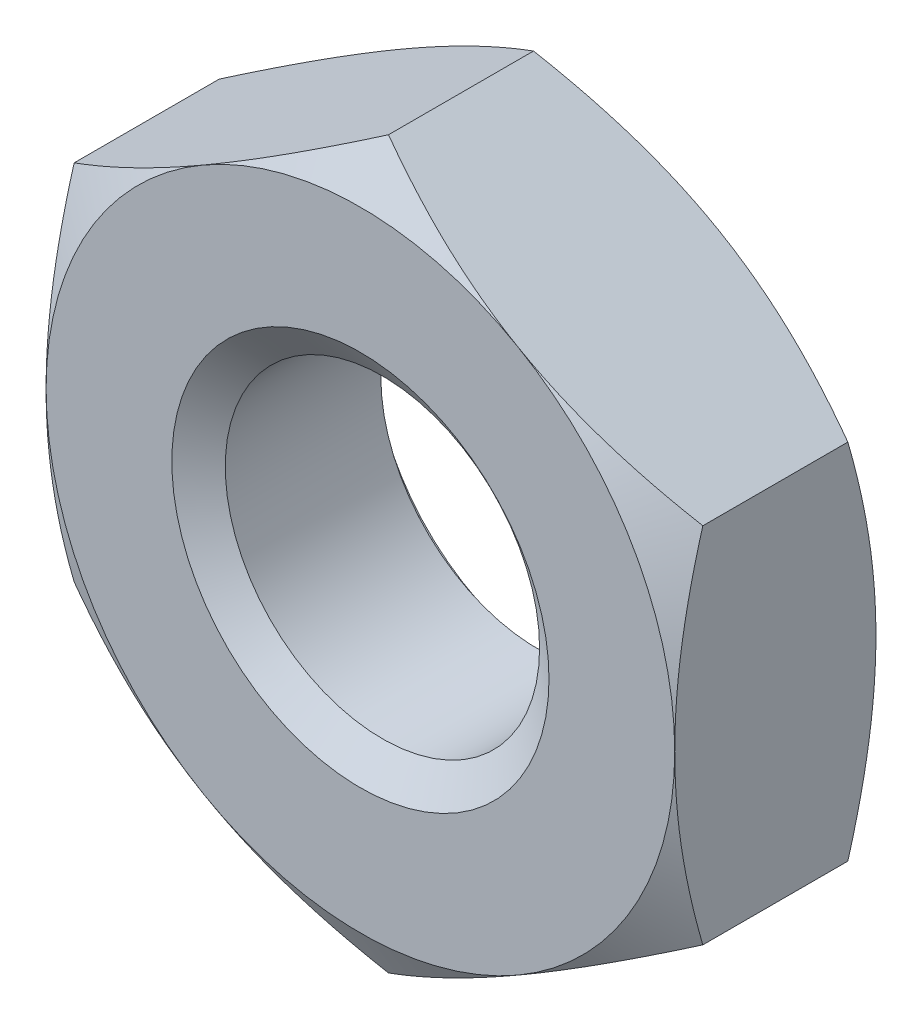
ISO-10303-21;
HEADER;
FILE_DESCRIPTION(('STEP AP214'),'2;1');
FILE_NAME('part.step','',(''),(''),'','','');
FILE_SCHEMA(('AUTOMOTIVE_DESIGN { 1 0 10303 214 1 1 1 1 }'));
ENDSEC;
DATA;
#1=APPLICATION_CONTEXT('core data for automotive mechanical design processes');
#2=APPLICATION_PROTOCOL_DEFINITION('international standard','automotive_design',2000,#1);
#3=PRODUCT_CONTEXT('',#1,'mechanical');
#4=PRODUCT('Part','Part','',(#3));
#5=PRODUCT_RELATED_PRODUCT_CATEGORY('part','',(#4));
#6=PRODUCT_DEFINITION_FORMATION('','',#4);
#7=PRODUCT_DEFINITION_CONTEXT('part definition',#1,'design');
#8=PRODUCT_DEFINITION('design','',#6,#7);
#9=PRODUCT_DEFINITION_SHAPE('','',#8);
#10=(LENGTH_UNIT() NAMED_UNIT(*) SI_UNIT(.MILLI.,.METRE.));
#11=(NAMED_UNIT(*) PLANE_ANGLE_UNIT() SI_UNIT($,.RADIAN.));
#12=(NAMED_UNIT(*) SI_UNIT($,.STERADIAN.) SOLID_ANGLE_UNIT());
#13=UNCERTAINTY_MEASURE_WITH_UNIT(LENGTH_MEASURE(1.E-05),#10,'distance_accuracy_value','');
#14=(GEOMETRIC_REPRESENTATION_CONTEXT(3) GLOBAL_UNCERTAINTY_ASSIGNED_CONTEXT((#13)) GLOBAL_UNIT_ASSIGNED_CONTEXT((#10,
#11,#12)) REPRESENTATION_CONTEXT('',''));
#15=CARTESIAN_POINT('',(0.,0.,0.));
#16=DIRECTION('',(0.,0.,1.));
#17=DIRECTION('',(1.,0.,0.));
#18=AXIS2_PLACEMENT_3D('',#15,#16,#17);
#19=CARTESIAN_POINT('',(0.,0.,-3.2));
#20=DIRECTION('',(0.,0.,1.));
#21=DIRECTION('',(1.,0.,0.));
#22=AXIS2_PLACEMENT_3D('',#19,#20,#21);
#23=CYLINDRICAL_SURFACE('',#22,2.5);
#24=CARTESIAN_POINT('',(0.,0.,-0.350103769104855));
#25=DIRECTION('',(0.,0.,1.));
#26=DIRECTION('',(1.,0.,0.));
#27=AXIS2_PLACEMENT_3D('',#24,#25,#26);
#28=CIRCLE('',#27,2.5);
#29=CARTESIAN_POINT('',(2.5,0.,-0.350103769104855));
#30=VERTEX_POINT('',#29);
#31=EDGE_CURVE('E177',#30,#30,#28,.F.);
#32=ORIENTED_EDGE('',*,*,#31,.F.);
#33=EDGE_LOOP('',(#32));
#34=FACE_BOUND('',#33,.T.);
#35=CARTESIAN_POINT('',(0.,0.,-2.82449623089514));
#36=DIRECTION('',(0.,0.,-1.));
#37=DIRECTION('',(-1.,0.,0.));
#38=AXIS2_PLACEMENT_3D('',#35,#36,#37);
#39=CIRCLE('',#38,2.5);
#40=CARTESIAN_POINT('',(-2.5,0.,-2.82449623089514));
#41=VERTEX_POINT('',#40);
#42=EDGE_CURVE('E42',#41,#41,#39,.F.);
#43=ORIENTED_EDGE('',*,*,#42,.F.);
#44=EDGE_LOOP('',(#43));
#45=FACE_BOUND('',#44,.T.);
#46=ADVANCED_FACE('F37',(#34,#45),#23,.F.);
#47=CARTESIAN_POINT('',(0.,5.77350269189626,-3.2));
#48=DIRECTION('',(0.,0.,-1.));
#49=DIRECTION('',(-1.,0.,0.));
#50=AXIS2_PLACEMENT_3D('',#47,#48,#49);
#51=PLANE('',#50);
#52=CARTESIAN_POINT('',(0.,0.,-3.2));
#53=DIRECTION('',(0.,0.,-1.));
#54=DIRECTION('',(-1.,0.,0.));
#55=AXIS2_PLACEMENT_3D('',#52,#53,#54);
#56=CIRCLE('',#55,5.);
#57=CARTESIAN_POINT('',(-5.,0.,-3.2));
#58=VERTEX_POINT('',#57);
#59=CARTESIAN_POINT('',(-2.5,-4.33012701892219,-3.2));
#60=VERTEX_POINT('',#59);
#61=EDGE_CURVE('E173',#58,#60,#56,.F.);
#62=ORIENTED_EDGE('',*,*,#61,.F.);
#63=CARTESIAN_POINT('',(-2.5,4.33012701892219,-3.2));
#64=VERTEX_POINT('',#63);
#65=EDGE_CURVE('E155',#64,#58,#56,.F.);
#66=ORIENTED_EDGE('',*,*,#65,.F.);
#67=CARTESIAN_POINT('',(2.5,4.33012701892219,-3.2));
#68=VERTEX_POINT('',#67);
#69=EDGE_CURVE('E172',#68,#64,#56,.F.);
#70=ORIENTED_EDGE('',*,*,#69,.F.);
#71=CARTESIAN_POINT('',(0.,0.,-3.2));
#72=DIRECTION('',(0.,0.,1.));
#73=DIRECTION('',(1.,0.,0.));
#74=AXIS2_PLACEMENT_3D('',#71,#72,#73);
#75=CIRCLE('',#74,5.);
#76=CARTESIAN_POINT('',(5.,0.,-3.2));
#77=VERTEX_POINT('',#76);
#78=EDGE_CURVE('E247',#77,#68,#75,.T.);
#79=ORIENTED_EDGE('',*,*,#78,.F.);
#80=CARTESIAN_POINT('',(2.5,-4.33012701892219,-3.2));
#81=VERTEX_POINT('',#80);
#82=EDGE_CURVE('E363',#81,#77,#56,.F.);
#83=ORIENTED_EDGE('',*,*,#82,.F.);
#84=EDGE_CURVE('E367',#60,#81,#56,.F.);
#85=ORIENTED_EDGE('',*,*,#84,.F.);
#86=EDGE_LOOP('',(#62,#66,#70,#79,#83,#85));
#87=FACE_BOUND('',#86,.T.);
#88=CARTESIAN_POINT('',(0.,0.,-3.2));
#89=DIRECTION('',(0.,0.,-1.));
#90=DIRECTION('',(-1.,0.,0.));
#91=AXIS2_PLACEMENT_3D('',#88,#89,#90);
#92=CIRCLE('',#91,3.);
#93=CARTESIAN_POINT('',(-3.,0.,-3.2));
#94=VERTEX_POINT('',#93);
#95=EDGE_CURVE('E180',#94,#94,#92,.F.);
#96=ORIENTED_EDGE('',*,*,#95,.T.);
#97=EDGE_LOOP('',(#96));
#98=FACE_BOUND('',#97,.T.);
#99=ADVANCED_FACE('F300',(#87,#98),#51,.T.);
#100=CARTESIAN_POINT('',(0.,5.77350269189626,0.));
#101=DIRECTION('',(0.,0.,-1.));
#102=DIRECTION('',(-1.,0.,0.));
#103=AXIS2_PLACEMENT_3D('',#100,#101,#102);
#104=PLANE('',#103);
#105=CARTESIAN_POINT('',(0.,0.,0.));
#106=DIRECTION('',(0.,0.,-1.));
#107=DIRECTION('',(-1.,0.,0.));
#108=AXIS2_PLACEMENT_3D('',#105,#106,#107);
#109=CIRCLE('',#108,5.);
#110=CARTESIAN_POINT('',(-5.,0.,0.));
#111=VERTEX_POINT('',#110);
#112=CARTESIAN_POINT('',(-2.5,4.33012701892219,0.));
#113=VERTEX_POINT('',#112);
#114=EDGE_CURVE('E11',#111,#113,#109,.T.);
#115=ORIENTED_EDGE('',*,*,#114,.F.);
#116=CARTESIAN_POINT('',(-2.5,-4.33012701892219,0.));
#117=VERTEX_POINT('',#116);
#118=EDGE_CURVE('E49',#117,#111,#109,.T.);
#119=ORIENTED_EDGE('',*,*,#118,.F.);
#120=CARTESIAN_POINT('',(2.5,-4.33012701892219,0.));
#121=VERTEX_POINT('',#120);
#122=EDGE_CURVE('E176',#121,#117,#109,.T.);
#123=ORIENTED_EDGE('',*,*,#122,.F.);
#124=CARTESIAN_POINT('',(5.,0.,0.));
#125=VERTEX_POINT('',#124);
#126=EDGE_CURVE('E354',#125,#121,#109,.T.);
#127=ORIENTED_EDGE('',*,*,#126,.F.);
#128=CARTESIAN_POINT('',(0.,0.,0.));
#129=DIRECTION('',(0.,0.,1.));
#130=DIRECTION('',(1.,0.,0.));
#131=AXIS2_PLACEMENT_3D('',#128,#129,#130);
#132=CIRCLE('',#131,5.);
#133=CARTESIAN_POINT('',(2.5,4.33012701892219,0.));
#134=VERTEX_POINT('',#133);
#135=EDGE_CURVE('E131',#125,#134,#132,.T.);
#136=ORIENTED_EDGE('',*,*,#135,.T.);
#137=EDGE_CURVE('E47',#113,#134,#109,.T.);
#138=ORIENTED_EDGE('',*,*,#137,.F.);
#139=EDGE_LOOP('',(#115,#119,#123,#127,#136,#138));
#140=FACE_BOUND('',#139,.T.);
#141=CARTESIAN_POINT('',(0.,0.,0.));
#142=DIRECTION('',(0.,0.,1.));
#143=DIRECTION('',(1.,0.,0.));
#144=AXIS2_PLACEMENT_3D('',#141,#142,#143);
#145=CIRCLE('',#144,3.);
#146=CARTESIAN_POINT('',(3.,0.,0.));
#147=VERTEX_POINT('',#146);
#148=EDGE_CURVE('E179',#147,#147,#145,.T.);
#149=ORIENTED_EDGE('',*,*,#148,.F.);
#150=EDGE_LOOP('',(#149));
#151=FACE_BOUND('',#150,.T.);
#152=ADVANCED_FACE('F252',(#140,#151),#104,.F.);
#153=CARTESIAN_POINT('',(0.,5.77350269189626,-3.2));
#154=DIRECTION('',(-0.500000000000001,0.866025403784438,0.));
#155=DIRECTION('',(-0.866025403784438,-0.500000000000001,0.));
#156=AXIS2_PLACEMENT_3D('',#153,#154,#155);
#157=PLANE('',#156);
#158=DIRECTION('',(0.,0.,1.));
#159=VECTOR('',#158,1.);
#160=CARTESIAN_POINT('',(-5.,2.88675134594813,-3.2));
#161=LINE('',#160,#159);
#162=CARTESIAN_POINT('',(-5.,2.88675134594813,-2.75341801261479));
#163=VERTEX_POINT('',#162);
#164=CARTESIAN_POINT('',(-5.,2.88675134594813,-0.446581987385205));
#165=VERTEX_POINT('',#164);
#166=EDGE_CURVE('E167',#163,#165,#161,.T.);
#167=ORIENTED_EDGE('',*,*,#166,.T.);
#168=CARTESIAN_POINT('',(-5.0002,2.88663587589429,-0.446648656051832));
#169=CARTESIAN_POINT('',(-4.78046540547481,3.01349970319368,-0.373386567637637));
#170=CARTESIAN_POINT('',(-4.55885141554042,3.14144859993849,-0.306751321918094));
#171=CARTESIAN_POINT('',(-4.11178600454649,3.39956193532121,-0.190438991010811));
#172=CARTESIAN_POINT('',(-3.88632664040923,3.52973095989718,-0.140803049915789));
#173=CARTESIAN_POINT('',(-3.43816769477649,3.78847564779798,-0.0635510254186975));
#174=CARTESIAN_POINT('',(-3.21553790689581,3.91701101576052,-0.0354203782834889));
#175=CARTESIAN_POINT('',(-2.88081009815336,4.11026620624323,-0.010194921953684));
#176=CARTESIAN_POINT('',(-2.76915780319494,4.17472868879311,-0.00461345976948341));
#177=CARTESIAN_POINT('',(-2.5457500293262,4.30371322717528,0.000797783248530168));
#178=CARTESIAN_POINT('',(-2.43399455370968,4.36823528110589,0.000627741741796764));
#179=CARTESIAN_POINT('',(-2.12781576914936,4.54500768479195,-0.00775363179203697));
#180=CARTESIAN_POINT('',(-1.93349391403278,4.65719946015293,-0.0218297718972522));
#181=CARTESIAN_POINT('',(-1.54613989800229,4.88083840557981,-0.0664652571094323));
#182=CARTESIAN_POINT('',(-1.35310909862843,4.9922847895602,-0.0970398601475101));
#183=CARTESIAN_POINT('',(-0.964974657525144,5.21637431361295,-0.173468493621167));
#184=CARTESIAN_POINT('',(-0.769920001358263,5.32898917185759,-0.219646378878683));
#185=CARTESIAN_POINT('',(-0.382719654641231,5.55253939626498,-0.324451794491938));
#186=CARTESIAN_POINT('',(-0.190569004591913,5.66347762579592,-0.383054703437379));
#187=CARTESIAN_POINT('',(0.000199999999999885,5.7736181619501,-0.446648656051834));
#188=B_SPLINE_CURVE_WITH_KNOTS('',3,(#168,#169,#170,#171,#172,#173,#174,#175,#176,#177,#178,
#179,#180,#181,#182,#183,#184,#185,#186,#187),.UNSPECIFIED.,.F.,.F.,(4,2,2,2,2,2,2,2,2,4),(0.,
0.792555841363092,1.58701660053334,2.36181537487281,2.74884076077326,3.13585419177295,
3.8096236259968,4.4840172390119,5.17336882348929,5.86136694793726),.UNSPECIFIED.);
#189=EDGE_CURVE('E136',#165,#113,#188,.T.);
#190=ORIENTED_EDGE('',*,*,#189,.T.);
#191=CARTESIAN_POINT('',(0.,5.77350269189626,-0.446581987385208));
#192=VERTEX_POINT('',#191);
#193=EDGE_CURVE('E56',#113,#192,#188,.T.);
#194=ORIENTED_EDGE('',*,*,#193,.T.);
#195=DIRECTION('',(0.,0.,1.));
#196=VECTOR('',#195,1.);
#197=CARTESIAN_POINT('',(0.,5.77350269189626,-3.2));
#198=LINE('',#197,#196);
#199=CARTESIAN_POINT('',(0.,5.77350269189626,-2.75341801261479));
#200=VERTEX_POINT('',#199);
#201=EDGE_CURVE('E152',#200,#192,#198,.T.);
#202=ORIENTED_EDGE('',*,*,#201,.F.);
#203=CARTESIAN_POINT('',(-5.0002,2.88663587589429,-2.75335134394817));
#204=CARTESIAN_POINT('',(-4.78046540547481,3.01349970319368,-2.82661343236236));
#205=CARTESIAN_POINT('',(-4.55885141554042,3.14144859993849,-2.89324867808191));
#206=CARTESIAN_POINT('',(-4.11178600454649,3.39956193532121,-3.00956100898919));
#207=CARTESIAN_POINT('',(-3.88632664040923,3.52973095989718,-3.05919695008421));
#208=CARTESIAN_POINT('',(-3.43816769477649,3.78847564779798,-3.1364489745813));
#209=CARTESIAN_POINT('',(-3.2155379068958,3.91701101576052,-3.16457962171651));
#210=CARTESIAN_POINT('',(-2.88081009815336,4.11026620624323,-3.18980507804632));
#211=CARTESIAN_POINT('',(-2.76915780319494,4.17472868879311,-3.19538654023052));
#212=CARTESIAN_POINT('',(-2.5457500293262,4.30371322717528,-3.20079778324853));
#213=CARTESIAN_POINT('',(-2.43399455370968,4.36823528110589,-3.2006277417418));
#214=CARTESIAN_POINT('',(-2.12781576914936,4.54500768479194,-3.19224636820796));
#215=CARTESIAN_POINT('',(-1.93349391403278,4.65719946015293,-3.17817022810275));
#216=CARTESIAN_POINT('',(-1.54613989800229,4.88083840557981,-3.13353474289057));
#217=CARTESIAN_POINT('',(-1.35310909862843,4.99228478956021,-3.10296013985249));
#218=CARTESIAN_POINT('',(-0.964974657525144,5.21637431361295,-3.02653150637883));
#219=CARTESIAN_POINT('',(-0.769920001358263,5.32898917185759,-2.98035362112132));
#220=CARTESIAN_POINT('',(-0.382719654641231,5.55253939626498,-2.87554820550806));
#221=CARTESIAN_POINT('',(-0.190569004591913,5.66347762579592,-2.81694529656262));
#222=CARTESIAN_POINT('',(0.000199999999999887,5.7736181619501,-2.75335134394817));
#223=B_SPLINE_CURVE_WITH_KNOTS('',3,(#203,#204,#205,#206,#207,#208,#209,#210,#211,#212,#213,
#214,#215,#216,#217,#218,#219,#220,#221,#222),.UNSPECIFIED.,.F.,.F.,(4,2,2,2,2,2,2,2,2,4),(0.,
0.792555841363092,1.58701660053334,2.36181537487281,2.74884076077326,3.13585419177295,
3.8096236259968,4.4840172390119,5.17336882348929,5.86136694793726),.UNSPECIFIED.);
#224=EDGE_CURVE('E170',#64,#200,#223,.T.);
#225=ORIENTED_EDGE('',*,*,#224,.F.);
#226=EDGE_CURVE('E262',#163,#64,#223,.T.);
#227=ORIENTED_EDGE('',*,*,#226,.F.);
#228=EDGE_LOOP('',(#167,#190,#194,#202,#225,#227));
#229=FACE_BOUND('',#228,.T.);
#230=ADVANCED_FACE('F39',(#229),#157,.T.);
#231=CARTESIAN_POINT('',(5.,2.88675134594813,-3.2));
#232=DIRECTION('',(0.500000000000001,0.866025403784438,0.));
#233=DIRECTION('',(-0.866025403784438,0.500000000000001,0.));
#234=AXIS2_PLACEMENT_3D('',#231,#232,#233);
#235=PLANE('',#234);
#236=ORIENTED_EDGE('',*,*,#201,.T.);
#237=CARTESIAN_POINT('',(-0.000199999999999944,5.7736181619501,-0.446648656051834));
#238=CARTESIAN_POINT('',(0.219534594525186,5.64675433465071,-0.37338656763764));
#239=CARTESIAN_POINT('',(0.441148584459581,5.5188054379059,-0.306751321918096));
#240=CARTESIAN_POINT('',(0.888213995453514,5.26069210252318,-0.190438991010813));
#241=CARTESIAN_POINT('',(1.11367335959078,5.13052307794721,-0.140803049915791));
#242=CARTESIAN_POINT('',(1.56183230522351,4.87177839004641,-0.0635510254186984));
#243=CARTESIAN_POINT('',(1.78446209310419,4.74324302208387,-0.0354203782834895));
#244=CARTESIAN_POINT('',(2.11918990184664,4.54998783160116,-0.0101949219536846));
#245=CARTESIAN_POINT('',(2.23084219680506,4.48552534905128,-0.00461345976948414));
#246=CARTESIAN_POINT('',(2.4542499706738,4.35654081066911,0.000797783248529637));
#247=CARTESIAN_POINT('',(2.56600544629032,4.2920187567385,0.00062774174179657));
#248=CARTESIAN_POINT('',(2.87218423085064,4.11524635305244,-0.00775363179203664));
#249=CARTESIAN_POINT('',(3.06650608596722,4.00305457769146,-0.021829771897252));
#250=CARTESIAN_POINT('',(3.45386010199771,3.77941563226457,-0.0664652571094318));
#251=CARTESIAN_POINT('',(3.64689090137157,3.66796924828418,-0.0970398601475091));
#252=CARTESIAN_POINT('',(4.03502534247486,3.44387972423144,-0.173468493621165));
#253=CARTESIAN_POINT('',(4.23007999864174,3.3312648659868,-0.219646378878682));
#254=CARTESIAN_POINT('',(4.61728034535877,3.1077146415794,-0.324451794491937));
#255=CARTESIAN_POINT('',(4.80943099540809,2.99677641204847,-0.383054703437377));
#256=CARTESIAN_POINT('',(5.0002,2.88663587589429,-0.446648656051832));
#257=B_SPLINE_CURVE_WITH_KNOTS('',3,(#237,#238,#239,#240,#241,#242,#243,#244,#245,#246,#247,
#248,#249,#250,#251,#252,#253,#254,#255,#256),.UNSPECIFIED.,.F.,.F.,(4,2,2,2,2,2,2,2,2,4),(0.,
0.792555841363092,1.58701660053334,2.36181537487281,2.74884076077326,3.13585419177296,
3.8096236259968,4.4840172390119,5.17336882348929,5.86136694793726),.UNSPECIFIED.);
#258=EDGE_CURVE('E146',#192,#134,#257,.T.);
#259=ORIENTED_EDGE('',*,*,#258,.T.);
#260=CARTESIAN_POINT('',(5.,2.88675134594813,-0.446581987385208));
#261=VERTEX_POINT('',#260);
#262=EDGE_CURVE('E63',#134,#261,#257,.T.);
#263=ORIENTED_EDGE('',*,*,#262,.T.);
#264=DIRECTION('',(0.,0.,1.));
#265=VECTOR('',#264,1.);
#266=CARTESIAN_POINT('',(5.,2.88675134594813,-3.2));
#267=LINE('',#266,#265);
#268=CARTESIAN_POINT('',(5.,2.88675134594813,-2.75341801261479));
#269=VERTEX_POINT('',#268);
#270=EDGE_CURVE('E145',#269,#261,#267,.T.);
#271=ORIENTED_EDGE('',*,*,#270,.F.);
#272=CARTESIAN_POINT('',(-0.00019999999999993,5.7736181619501,-2.75335134394817));
#273=CARTESIAN_POINT('',(0.219534594525186,5.64675433465071,-2.82661343236236));
#274=CARTESIAN_POINT('',(0.441148584459581,5.5188054379059,-2.8932486780819));
#275=CARTESIAN_POINT('',(0.888213995453514,5.26069210252318,-3.00956100898919));
#276=CARTESIAN_POINT('',(1.11367335959078,5.13052307794721,-3.05919695008421));
#277=CARTESIAN_POINT('',(1.56183230522351,4.87177839004641,-3.1364489745813));
#278=CARTESIAN_POINT('',(1.78446209310419,4.74324302208387,-3.16457962171651));
#279=CARTESIAN_POINT('',(2.11918990184664,4.54998783160116,-3.18980507804632));
#280=CARTESIAN_POINT('',(2.23084219680506,4.48552534905128,-3.19538654023052));
#281=CARTESIAN_POINT('',(2.4542499706738,4.35654081066911,-3.20079778324853));
#282=CARTESIAN_POINT('',(2.56600544629032,4.2920187567385,-3.2006277417418));
#283=CARTESIAN_POINT('',(2.87218423085064,4.11524635305244,-3.19224636820796));
#284=CARTESIAN_POINT('',(3.06650608596722,4.00305457769146,-3.17817022810275));
#285=CARTESIAN_POINT('',(3.45386010199771,3.77941563226457,-3.13353474289057));
#286=CARTESIAN_POINT('',(3.64689090137157,3.66796924828418,-3.10296013985249));
#287=CARTESIAN_POINT('',(4.03502534247486,3.44387972423144,-3.02653150637884));
#288=CARTESIAN_POINT('',(4.23007999864174,3.3312648659868,-2.98035362112132));
#289=CARTESIAN_POINT('',(4.61728034535877,3.1077146415794,-2.87554820550806));
#290=CARTESIAN_POINT('',(4.80943099540809,2.99677641204847,-2.81694529656262));
#291=CARTESIAN_POINT('',(5.0002,2.88663587589429,-2.75335134394817));
#292=B_SPLINE_CURVE_WITH_KNOTS('',3,(#272,#273,#274,#275,#276,#277,#278,#279,#280,#281,#282,
#283,#284,#285,#286,#287,#288,#289,#290,#291),.UNSPECIFIED.,.F.,.F.,(4,2,2,2,2,2,2,2,2,4),(0.,
0.792555841363092,1.58701660053334,2.36181537487281,2.74884076077326,3.13585419177296,
3.8096236259968,4.4840172390119,5.17336882348929,5.86136694793726),.UNSPECIFIED.);
#293=EDGE_CURVE('E256',#68,#269,#292,.T.);
#294=ORIENTED_EDGE('',*,*,#293,.F.);
#295=EDGE_CURVE('E261',#200,#68,#292,.T.);
#296=ORIENTED_EDGE('',*,*,#295,.F.);
#297=EDGE_LOOP('',(#236,#259,#263,#271,#294,#296));
#298=FACE_BOUND('',#297,.T.);
#299=ADVANCED_FACE('F143',(#298),#235,.T.);
#300=CARTESIAN_POINT('',(5.,2.88675134594813,-3.2));
#301=DIRECTION('',(-1.,0.,0.));
#302=DIRECTION('',(0.,0.,1.));
#303=AXIS2_PLACEMENT_3D('',#300,#301,#302);
#304=PLANE('',#303);
#305=CARTESIAN_POINT('',(5.,-7.65608998744865,-2.39263352655081));
#306=CARTESIAN_POINT('',(5.,-7.43656171400166,-2.28654533817208));
#307=CARTESIAN_POINT('',(5.,-7.21651440170022,-2.18151175461596));
#308=CARTESIAN_POINT('',(5.,-6.77510105921518,-1.97415643363977));
#309=CARTESIAN_POINT('',(5.,-6.55373480873053,-1.87183516574569));
#310=CARTESIAN_POINT('',(5.,-6.10820714710357,-1.66996807853491));
#311=CARTESIAN_POINT('',(5.,-5.88403698971124,-1.57044149281731));
#312=CARTESIAN_POINT('',(5.,-5.43385418074677,-1.37566323278682));
#313=CARTESIAN_POINT('',(5.,-5.20784162594278,-1.28041133564243));
#314=CARTESIAN_POINT('',(5.,-4.75080884782756,-1.09418830918942));
#315=CARTESIAN_POINT('',(5.,-4.51976121099505,-1.0032840909987));
#316=CARTESIAN_POINT('',(5.,-4.054940534221,-0.828595302971952));
#317=CARTESIAN_POINT('',(5.,-3.82116719434025,-0.744811525247655));
#318=CARTESIAN_POINT('',(5.,-3.35100416711889,-0.586614632364621));
#319=CARTESIAN_POINT('',(5.,-3.11462125088188,-0.512181595225273));
#320=CARTESIAN_POINT('',(5.,-2.63849247870023,-0.375104393872379));
#321=CARTESIAN_POINT('',(5.,-2.3987477121033,-0.31245650159695));
#322=CARTESIAN_POINT('',(5.,-1.91574303714497,-0.201987753994869));
#323=CARTESIAN_POINT('',(5.,-1.672482210841,-0.154170846558642));
#324=CARTESIAN_POINT('',(5.,-1.18299359688664,-0.0765955557924025));
#325=CARTESIAN_POINT('',(5.,-0.936765806613279,-0.0468371884284092));
#326=CARTESIAN_POINT('',(5.,-0.567032279323846,-0.0176512015862964));
#327=CARTESIAN_POINT('',(5.,-0.444105297658538,-0.0104963190599469));
#328=CARTESIAN_POINT('',(5.,-0.198053005238564,-0.00139545226904072));
#329=CARTESIAN_POINT('',(5.,-0.0749276970802274,0.000550599639614562));
#330=CARTESIAN_POINT('',(5.,0.171257999892354,-0.000818470345664083));
#331=CARTESIAN_POINT('',(5.,0.29431839722709,-0.00413211431301174));
#332=CARTESIAN_POINT('',(5.,0.540192730788842,-0.0159365972827602));
#333=CARTESIAN_POINT('',(5.,0.663006654263485,-0.0244276975701652));
#334=CARTESIAN_POINT('',(5.,0.960681872881669,-0.0511063802753011));
#335=CARTESIAN_POINT('',(5.,1.1353143627994,-0.0718889676982867));
#336=CARTESIAN_POINT('',(5.,1.48321675799389,-0.122765655722696));
#337=CARTESIAN_POINT('',(5.,1.65648647841236,-0.152860997990035));
#338=CARTESIAN_POINT('',(5.,2.00155426058699,-0.221298792011552));
#339=CARTESIAN_POINT('',(5.,2.17335067370373,-0.259649477486405));
#340=CARTESIAN_POINT('',(5.,2.51518168221054,-0.343428305385012));
#341=CARTESIAN_POINT('',(5.,2.6852163841931,-0.388856016914002));
#342=CARTESIAN_POINT('',(5.,3.02770318928892,-0.486887782054293));
#343=CARTESIAN_POINT('',(5.,3.20011248435311,-0.539640363823942));
#344=CARTESIAN_POINT('',(5.,3.54310870430176,-0.650357787302626));
#345=CARTESIAN_POINT('',(5.,3.71369679659714,-0.70831903390707));
#346=CARTESIAN_POINT('',(5.,4.05236610267973,-0.828256540728473));
#347=CARTESIAN_POINT('',(5.,4.22045602230055,-0.890208365426365));
#348=CARTESIAN_POINT('',(5.,4.55533171687448,-1.01774823413812));
#349=CARTESIAN_POINT('',(5.,4.72211693321414,-1.08333774778777));
#350=CARTESIAN_POINT('',(5.,4.88829623733355,-1.15038625817724));
#351=B_SPLINE_CURVE_WITH_KNOTS('',3,(#305,#306,#307,#308,#309,#310,#311,#312,#313,#314,#315,
#316,#317,#318,#319,#320,#321,#322,#323,#324,#325,#326,#327,#328,#329,#330,#331,#332,#333,#334,
#335,#336,#337,#338,#339,#340,#341,#342,#343,#344,#345,#346,#347,#348,#349,#350),.UNSPECIFIED.,
.F.,.F.,(4,2,2,2,2,2,2,2,2,2,2,2,2,2,2,2,2,2,2,2,2,2,4),(0.,0.731464740665351,1.46305528824908,
2.19883243307486,2.93457117856034,3.67934251246858,4.42419659013361,5.1674358087199,
5.91043951739339,6.65364083834807,7.39684281638516,7.76615414335457,8.13546067426611,
8.50466345177856,8.87388486298453,9.40118542949727,9.92855633110015,10.4564556797854,
10.9843228991235,11.525120280828,12.065547221064,12.6029322754131,13.1405360390026),.UNSPECIFIED.);
#352=CARTESIAN_POINT('',(5.,-2.88675134594813,-0.446581987385208));
#353=VERTEX_POINT('',#352);
#354=EDGE_CURVE('E138',#353,#125,#351,.T.);
#355=ORIENTED_EDGE('',*,*,#354,.F.);
#356=DIRECTION('',(0.,0.,1.));
#357=VECTOR('',#356,1.);
#358=CARTESIAN_POINT('',(5.,-2.88675134594813,-3.2));
#359=LINE('',#358,#357);
#360=CARTESIAN_POINT('',(5.,-2.88675134594813,-2.75341801261479));
#361=VERTEX_POINT('',#360);
#362=EDGE_CURVE('E153',#361,#353,#359,.T.);
#363=ORIENTED_EDGE('',*,*,#362,.F.);
#364=CARTESIAN_POINT('',(5.,-7.65608998744865,-0.807366473449195));
#365=CARTESIAN_POINT('',(5.,-7.43656171400166,-0.913454661827922));
#366=CARTESIAN_POINT('',(5.,-7.21651440170022,-1.01848824538404));
#367=CARTESIAN_POINT('',(5.,-6.77510105921518,-1.22584356636023));
#368=CARTESIAN_POINT('',(5.,-6.55373480873052,-1.32816483425431));
#369=CARTESIAN_POINT('',(5.,-6.10820714710357,-1.53003192146509));
#370=CARTESIAN_POINT('',(5.,-5.88403698971124,-1.62955850718269));
#371=CARTESIAN_POINT('',(5.,-5.43385418074677,-1.82433676721318));
#372=CARTESIAN_POINT('',(5.,-5.20784162594278,-1.91958866435757));
#373=CARTESIAN_POINT('',(5.,-4.75080884782756,-2.10581169081058));
#374=CARTESIAN_POINT('',(5.,-4.51976121099505,-2.1967159090013));
#375=CARTESIAN_POINT('',(5.,-4.05494053422099,-2.37140469702805));
#376=CARTESIAN_POINT('',(5.,-3.82116719434025,-2.45518847475235));
#377=CARTESIAN_POINT('',(5.,-3.35100416711889,-2.61338536763538));
#378=CARTESIAN_POINT('',(5.,-3.11462125088188,-2.68781840477473));
#379=CARTESIAN_POINT('',(5.,-2.63849247870023,-2.82489560612762));
#380=CARTESIAN_POINT('',(5.,-2.3987477121033,-2.88754349840305));
#381=CARTESIAN_POINT('',(5.,-1.91574303714497,-2.99801224600513));
#382=CARTESIAN_POINT('',(5.,-1.672482210841,-3.04582915344136));
#383=CARTESIAN_POINT('',(5.,-1.18299359688664,-3.1234044442076));
#384=CARTESIAN_POINT('',(5.,-0.936765806613281,-3.15316281157159));
#385=CARTESIAN_POINT('',(5.,-0.567032279323847,-3.1823487984137));
#386=CARTESIAN_POINT('',(5.,-0.444105297658539,-3.18950368094005));
#387=CARTESIAN_POINT('',(5.,-0.198053005238564,-3.19860454773096));
#388=CARTESIAN_POINT('',(5.,-0.0749276970802276,-3.20055059963961));
#389=CARTESIAN_POINT('',(5.,0.171257999892354,-3.19918152965434));
#390=CARTESIAN_POINT('',(5.,0.294318397227089,-3.19586788568699));
#391=CARTESIAN_POINT('',(5.,0.540192730788842,-3.18406340271724));
#392=CARTESIAN_POINT('',(5.,0.663006654263486,-3.17557230242983));
#393=CARTESIAN_POINT('',(5.,0.960681872881669,-3.1488936197247));
#394=CARTESIAN_POINT('',(5.,1.1353143627994,-3.12811103230171));
#395=CARTESIAN_POINT('',(5.,1.48321675799389,-3.0772343442773));
#396=CARTESIAN_POINT('',(5.,1.65648647841236,-3.04713900200997));
#397=CARTESIAN_POINT('',(5.,2.00155426058699,-2.97870120798845));
#398=CARTESIAN_POINT('',(5.,2.17335067370373,-2.9403505225136));
#399=CARTESIAN_POINT('',(5.,2.51518168221054,-2.85657169461499));
#400=CARTESIAN_POINT('',(5.,2.6852163841931,-2.811143983086));
#401=CARTESIAN_POINT('',(5.,3.02770318928892,-2.71311221794571));
#402=CARTESIAN_POINT('',(5.,3.20011248435311,-2.66035963617606));
#403=CARTESIAN_POINT('',(5.,3.54310870430176,-2.54964221269737));
#404=CARTESIAN_POINT('',(5.,3.71369679659714,-2.49168096609293));
#405=CARTESIAN_POINT('',(5.,4.05236610267973,-2.37174345927153));
#406=CARTESIAN_POINT('',(5.,4.22045602230055,-2.30979163457364));
#407=CARTESIAN_POINT('',(5.,4.55533171687448,-2.18225176586188));
#408=CARTESIAN_POINT('',(5.,4.72211693321414,-2.11666225221223));
#409=CARTESIAN_POINT('',(5.,4.88829623733355,-2.04961374182276));
#410=B_SPLINE_CURVE_WITH_KNOTS('',3,(#364,#365,#366,#367,#368,#369,#370,#371,#372,#373,#374,
#375,#376,#377,#378,#379,#380,#381,#382,#383,#384,#385,#386,#387,#388,#389,#390,#391,#392,#393,
#394,#395,#396,#397,#398,#399,#400,#401,#402,#403,#404,#405,#406,#407,#408,#409),.UNSPECIFIED.,
.F.,.F.,(4,2,2,2,2,2,2,2,2,2,2,2,2,2,2,2,2,2,2,2,2,2,4),(0.,0.731464740665352,1.46305528824909,
2.19883243307486,2.93457117856034,3.67934251246858,4.42419659013362,5.1674358087199,
5.91043951739339,6.65364083834806,7.39684281638516,7.76615414335457,8.13546067426611,
8.50466345177856,8.87388486298453,9.40118542949728,9.92855633110015,10.4564556797854,
10.9843228991235,11.525120280828,12.065547221064,12.6029322754131,13.1405360390026),.UNSPECIFIED.);
#411=EDGE_CURVE('E268',#361,#77,#410,.T.);
#412=ORIENTED_EDGE('',*,*,#411,.T.);
#413=EDGE_CURVE('E151',#77,#269,#410,.T.);
#414=ORIENTED_EDGE('',*,*,#413,.T.);
#415=ORIENTED_EDGE('',*,*,#270,.T.);
#416=EDGE_CURVE('E128',#125,#261,#351,.T.);
#417=ORIENTED_EDGE('',*,*,#416,.F.);
#418=EDGE_LOOP('',(#355,#363,#412,#414,#415,#417));
#419=FACE_BOUND('',#418,.T.);
#420=ADVANCED_FACE('F149',(#419),#304,.F.);
#421=CARTESIAN_POINT('',(0.,-5.77350269189627,-3.2));
#422=DIRECTION('',(0.500000000000001,-0.866025403784438,0.));
#423=DIRECTION('',(0.866025403784438,0.500000000000001,0.));
#424=AXIS2_PLACEMENT_3D('',#421,#422,#423);
#425=PLANE('',#424);
#426=ORIENTED_EDGE('',*,*,#362,.T.);
#427=CARTESIAN_POINT('',(5.0002,-2.8866358758943,-0.446648656051834));
#428=CARTESIAN_POINT('',(4.78046540547481,-3.01349970319368,-0.373386567637639));
#429=CARTESIAN_POINT('',(4.55885141554042,-3.14144859993849,-0.306751321918095));
#430=CARTESIAN_POINT('',(4.11178600454648,-3.39956193532121,-0.190438991010813));
#431=CARTESIAN_POINT('',(3.88632664040922,-3.52973095989718,-0.140803049915791));
#432=CARTESIAN_POINT('',(3.43816769477649,-3.78847564779798,-0.0635510254186998));
#433=CARTESIAN_POINT('',(3.2155379068958,-3.91701101576052,-0.0354203782834916));
#434=CARTESIAN_POINT('',(2.88081009815335,-4.11026620624323,-0.0101949219536866));
#435=CARTESIAN_POINT('',(2.76915780319494,-4.17472868879311,-0.00461345976948596));
#436=CARTESIAN_POINT('',(2.5457500293262,-4.30371322717528,0.000797783248527456));
#437=CARTESIAN_POINT('',(2.43399455370968,-4.3682352811059,0.000627741741793833));
#438=CARTESIAN_POINT('',(2.12781576914936,-4.54500768479195,-0.00775363179204044));
#439=CARTESIAN_POINT('',(1.93349391403278,-4.65719946015293,-0.021829771897256));
#440=CARTESIAN_POINT('',(1.54613989800229,-4.88083840557982,-0.0664652571094358));
#441=CARTESIAN_POINT('',(1.35310909862843,-4.99228478956021,-0.0970398601475132));
#442=CARTESIAN_POINT('',(0.964974657525143,-5.21637431361296,-0.17346849362117));
#443=CARTESIAN_POINT('',(0.769920001358262,-5.3289891718576,-0.219646378878687));
#444=CARTESIAN_POINT('',(0.38271965464123,-5.55253939626499,-0.324451794491942));
#445=CARTESIAN_POINT('',(0.190569004591913,-5.66347762579593,-0.383054703437383));
#446=CARTESIAN_POINT('',(-0.000200000000000091,-5.7736181619501,-0.446648656051837));
#447=B_SPLINE_CURVE_WITH_KNOTS('',3,(#427,#428,#429,#430,#431,#432,#433,#434,#435,#436,#437,
#438,#439,#440,#441,#442,#443,#444,#445,#446),.UNSPECIFIED.,.F.,.F.,(4,2,2,2,2,2,2,2,2,4),(0.,
0.792555841363093,1.58701660053334,2.36181537487281,2.74884076077326,3.13585419177295,
3.8096236259968,4.4840172390119,5.17336882348929,5.86136694793725),.UNSPECIFIED.);
#448=EDGE_CURVE('E349',#353,#121,#447,.T.);
#449=ORIENTED_EDGE('',*,*,#448,.T.);
#450=CARTESIAN_POINT('',(0.,-5.77350269189626,-0.446581987385208));
#451=VERTEX_POINT('',#450);
#452=EDGE_CURVE('E228',#121,#451,#447,.T.);
#453=ORIENTED_EDGE('',*,*,#452,.T.);
#454=DIRECTION('',(0.,0.,1.));
#455=VECTOR('',#454,1.);
#456=CARTESIAN_POINT('',(0.,-5.77350269189627,-3.2));
#457=LINE('',#456,#455);
#458=CARTESIAN_POINT('',(0.,-5.77350269189626,-2.75341801261479));
#459=VERTEX_POINT('',#458);
#460=EDGE_CURVE('E158',#459,#451,#457,.T.);
#461=ORIENTED_EDGE('',*,*,#460,.F.);
#462=CARTESIAN_POINT('',(5.0002,-2.8866358758943,-2.75335134394817));
#463=CARTESIAN_POINT('',(4.78046540547481,-3.01349970319368,-2.82661343236236));
#464=CARTESIAN_POINT('',(4.55885141554042,-3.14144859993849,-2.8932486780819));
#465=CARTESIAN_POINT('',(4.11178600454648,-3.39956193532121,-3.00956100898919));
#466=CARTESIAN_POINT('',(3.88632664040922,-3.52973095989718,-3.05919695008421));
#467=CARTESIAN_POINT('',(3.43816769477649,-3.78847564779798,-3.1364489745813));
#468=CARTESIAN_POINT('',(3.2155379068958,-3.91701101576052,-3.16457962171651));
#469=CARTESIAN_POINT('',(2.88081009815335,-4.11026620624323,-3.18980507804631));
#470=CARTESIAN_POINT('',(2.76915780319494,-4.17472868879311,-3.19538654023051));
#471=CARTESIAN_POINT('',(2.5457500293262,-4.30371322717528,-3.20079778324853));
#472=CARTESIAN_POINT('',(2.43399455370968,-4.3682352811059,-3.20062774174179));
#473=CARTESIAN_POINT('',(2.12781576914936,-4.54500768479195,-3.19224636820796));
#474=CARTESIAN_POINT('',(1.93349391403278,-4.65719946015293,-3.17817022810274));
#475=CARTESIAN_POINT('',(1.54613989800229,-4.88083840557982,-3.13353474289056));
#476=CARTESIAN_POINT('',(1.35310909862843,-4.99228478956021,-3.10296013985249));
#477=CARTESIAN_POINT('',(0.964974657525143,-5.21637431361296,-3.02653150637883));
#478=CARTESIAN_POINT('',(0.769920001358262,-5.3289891718576,-2.98035362112131));
#479=CARTESIAN_POINT('',(0.38271965464123,-5.55253939626499,-2.87554820550806));
#480=CARTESIAN_POINT('',(0.190569004591913,-5.66347762579593,-2.81694529656262));
#481=CARTESIAN_POINT('',(-0.000200000000000087,-5.7736181619501,-2.75335134394816));
#482=B_SPLINE_CURVE_WITH_KNOTS('',3,(#462,#463,#464,#465,#466,#467,#468,#469,#470,#471,#472,
#473,#474,#475,#476,#477,#478,#479,#480,#481),.UNSPECIFIED.,.F.,.F.,(4,2,2,2,2,2,2,2,2,4),(0.,
0.792555841363093,1.58701660053334,2.36181537487281,2.74884076077326,3.13585419177295,
3.8096236259968,4.4840172390119,5.17336882348929,5.86136694793726),.UNSPECIFIED.);
#483=EDGE_CURVE('E274',#81,#459,#482,.T.);
#484=ORIENTED_EDGE('',*,*,#483,.F.);
#485=EDGE_CURVE('E273',#361,#81,#482,.T.);
#486=ORIENTED_EDGE('',*,*,#485,.F.);
#487=EDGE_LOOP('',(#426,#449,#453,#461,#484,#486));
#488=FACE_BOUND('',#487,.T.);
#489=ADVANCED_FACE('F284',(#488),#425,.T.);
#490=CARTESIAN_POINT('',(-5.,-2.88675134594813,-3.2));
#491=DIRECTION('',(-0.500000000000001,-0.866025403784438,0.));
#492=DIRECTION('',(0.866025403784438,-0.500000000000001,0.));
#493=AXIS2_PLACEMENT_3D('',#490,#491,#492);
#494=PLANE('',#493);
#495=ORIENTED_EDGE('',*,*,#460,.T.);
#496=CARTESIAN_POINT('',(0.000199999999999675,-5.7736181619501,-0.446648656051837));
#497=CARTESIAN_POINT('',(-0.219534594525186,-5.64675433465071,-0.373386567637642));
#498=CARTESIAN_POINT('',(-0.441148584459582,-5.5188054379059,-0.306751321918099));
#499=CARTESIAN_POINT('',(-0.888213995453516,-5.26069210252319,-0.190438991010816));
#500=CARTESIAN_POINT('',(-1.11367335959078,-5.13052307794722,-0.140803049915793));
#501=CARTESIAN_POINT('',(-1.56183230522351,-4.87177839004641,-0.0635510254187014));
#502=CARTESIAN_POINT('',(-1.7844620931042,-4.74324302208387,-0.0354203782834928));
#503=CARTESIAN_POINT('',(-2.11918990184665,-4.54998783160117,-0.0101949219536873));
#504=CARTESIAN_POINT('',(-2.23084219680507,-4.48552534905128,-0.00461345976948643));
#505=CARTESIAN_POINT('',(-2.4542499706738,-4.35654081066911,0.000797783248527422));
#506=CARTESIAN_POINT('',(-2.56600544629032,-4.2920187567385,0.000627741741794034));
#507=CARTESIAN_POINT('',(-2.87218423085065,-4.11524635305245,-0.00775363179203975));
#508=CARTESIAN_POINT('',(-3.06650608596722,-4.00305457769146,-0.0218297718972551));
#509=CARTESIAN_POINT('',(-3.45386010199771,-3.77941563226458,-0.0664652571094346));
#510=CARTESIAN_POINT('',(-3.64689090137157,-3.66796924828419,-0.0970398601475116));
#511=CARTESIAN_POINT('',(-4.03502534247486,-3.44387972423144,-0.173468493621167));
#512=CARTESIAN_POINT('',(-4.23007999864174,-3.3312648659868,-0.219646378878684));
#513=CARTESIAN_POINT('',(-4.61728034535877,-3.10771464157941,-0.324451794491939));
#514=CARTESIAN_POINT('',(-4.80943099540809,-2.99677641204847,-0.383054703437379));
#515=CARTESIAN_POINT('',(-5.0002,-2.8866358758943,-0.446648656051833));
#516=B_SPLINE_CURVE_WITH_KNOTS('',3,(#496,#497,#498,#499,#500,#501,#502,#503,#504,#505,#506,
#507,#508,#509,#510,#511,#512,#513,#514,#515),.UNSPECIFIED.,.F.,.F.,(4,2,2,2,2,2,2,2,2,4),(0.,
0.792555841363093,1.58701660053334,2.36181537487281,2.74884076077326,3.13585419177296,
3.8096236259968,4.4840172390119,5.17336882348929,5.86136694793725),.UNSPECIFIED.);
#517=EDGE_CURVE('E347',#451,#117,#516,.T.);
#518=ORIENTED_EDGE('',*,*,#517,.T.);
#519=CARTESIAN_POINT('',(-5.,-2.88675134594813,-0.446581987385208));
#520=VERTEX_POINT('',#519);
#521=EDGE_CURVE('E202',#117,#520,#516,.T.);
#522=ORIENTED_EDGE('',*,*,#521,.T.);
#523=DIRECTION('',(0.,0.,1.));
#524=VECTOR('',#523,1.);
#525=CARTESIAN_POINT('',(-5.,-2.88675134594813,-3.2));
#526=LINE('',#525,#524);
#527=CARTESIAN_POINT('',(-5.,-2.88675134594813,-2.75341801261479));
#528=VERTEX_POINT('',#527);
#529=EDGE_CURVE('E164',#528,#520,#526,.T.);
#530=ORIENTED_EDGE('',*,*,#529,.F.);
#531=CARTESIAN_POINT('',(0.000199999999999675,-5.7736181619501,-2.75335134394816));
#532=CARTESIAN_POINT('',(-0.219534594525186,-5.64675433465071,-2.82661343236236));
#533=CARTESIAN_POINT('',(-0.441148584459582,-5.5188054379059,-2.8932486780819));
#534=CARTESIAN_POINT('',(-0.888213995453516,-5.26069210252319,-3.00956100898918));
#535=CARTESIAN_POINT('',(-1.11367335959078,-5.13052307794721,-3.05919695008421));
#536=CARTESIAN_POINT('',(-1.56183230522351,-4.87177839004642,-3.1364489745813));
#537=CARTESIAN_POINT('',(-1.7844620931042,-4.74324302208387,-3.16457962171651));
#538=CARTESIAN_POINT('',(-2.11918990184665,-4.54998783160117,-3.18980507804631));
#539=CARTESIAN_POINT('',(-2.23084219680507,-4.48552534905128,-3.19538654023051));
#540=CARTESIAN_POINT('',(-2.4542499706738,-4.35654081066911,-3.20079778324853));
#541=CARTESIAN_POINT('',(-2.56600544629032,-4.2920187567385,-3.20062774174179));
#542=CARTESIAN_POINT('',(-2.87218423085065,-4.11524635305245,-3.19224636820796));
#543=CARTESIAN_POINT('',(-3.06650608596722,-4.00305457769146,-3.17817022810275));
#544=CARTESIAN_POINT('',(-3.45386010199771,-3.77941563226458,-3.13353474289057));
#545=CARTESIAN_POINT('',(-3.64689090137157,-3.66796924828419,-3.10296013985249));
#546=CARTESIAN_POINT('',(-4.03502534247486,-3.44387972423144,-3.02653150637883));
#547=CARTESIAN_POINT('',(-4.23007999864174,-3.3312648659868,-2.98035362112132));
#548=CARTESIAN_POINT('',(-4.61728034535877,-3.10771464157941,-2.87554820550806));
#549=CARTESIAN_POINT('',(-4.80943099540809,-2.99677641204847,-2.81694529656262));
#550=CARTESIAN_POINT('',(-5.0002,-2.8866358758943,-2.75335134394817));
#551=B_SPLINE_CURVE_WITH_KNOTS('',3,(#531,#532,#533,#534,#535,#536,#537,#538,#539,#540,#541,
#542,#543,#544,#545,#546,#547,#548,#549,#550),.UNSPECIFIED.,.F.,.F.,(4,2,2,2,2,2,2,2,2,4),(0.,
0.792555841363093,1.58701660053334,2.36181537487281,2.74884076077326,3.13585419177296,
3.8096236259968,4.4840172390119,5.17336882348929,5.86136694793726),.UNSPECIFIED.);
#552=EDGE_CURVE('E280',#60,#528,#551,.T.);
#553=ORIENTED_EDGE('',*,*,#552,.F.);
#554=EDGE_CURVE('E279',#459,#60,#551,.T.);
#555=ORIENTED_EDGE('',*,*,#554,.F.);
#556=EDGE_LOOP('',(#495,#518,#522,#530,#553,#555));
#557=FACE_BOUND('',#556,.T.);
#558=ADVANCED_FACE('F287',(#557),#494,.T.);
#559=CARTESIAN_POINT('',(-5.,2.88675134594813,-3.2));
#560=DIRECTION('',(-1.,0.,0.));
#561=DIRECTION('',(0.,0.,1.));
#562=AXIS2_PLACEMENT_3D('',#559,#560,#561);
#563=PLANE('',#562);
#564=ORIENTED_EDGE('',*,*,#529,.T.);
#565=CARTESIAN_POINT('',(-5.,-7.65608998744865,-2.39263352655081));
#566=CARTESIAN_POINT('',(-5.,-7.43656171400166,-2.28654533817208));
#567=CARTESIAN_POINT('',(-5.,-7.21651440170022,-2.18151175461596));
#568=CARTESIAN_POINT('',(-5.,-6.77510105921518,-1.97415643363977));
#569=CARTESIAN_POINT('',(-5.,-6.55373480873053,-1.87183516574569));
#570=CARTESIAN_POINT('',(-5.,-6.10820714710357,-1.66996807853491));
#571=CARTESIAN_POINT('',(-5.,-5.88403698971124,-1.57044149281731));
#572=CARTESIAN_POINT('',(-5.,-5.43385418074677,-1.37566323278682));
#573=CARTESIAN_POINT('',(-5.,-5.20784162594278,-1.28041133564243));
#574=CARTESIAN_POINT('',(-5.,-4.75080884782756,-1.09418830918942));
#575=CARTESIAN_POINT('',(-5.,-4.51976121099505,-1.0032840909987));
#576=CARTESIAN_POINT('',(-5.,-4.054940534221,-0.828595302971952));
#577=CARTESIAN_POINT('',(-5.,-3.82116719434025,-0.744811525247655));
#578=CARTESIAN_POINT('',(-5.,-3.35100416711889,-0.586614632364621));
#579=CARTESIAN_POINT('',(-5.,-3.11462125088188,-0.512181595225273));
#580=CARTESIAN_POINT('',(-5.,-2.63849247870023,-0.375104393872379));
#581=CARTESIAN_POINT('',(-5.,-2.3987477121033,-0.31245650159695));
#582=CARTESIAN_POINT('',(-5.,-1.91574303714497,-0.201987753994869));
#583=CARTESIAN_POINT('',(-5.,-1.672482210841,-0.154170846558642));
#584=CARTESIAN_POINT('',(-5.,-1.18299359688664,-0.0765955557924025));
#585=CARTESIAN_POINT('',(-5.,-0.936765806613279,-0.0468371884284092));
#586=CARTESIAN_POINT('',(-5.,-0.567032279323846,-0.0176512015862964));
#587=CARTESIAN_POINT('',(-5.,-0.444105297658538,-0.0104963190599469));
#588=CARTESIAN_POINT('',(-5.,-0.198053005238564,-0.00139545226904072));
#589=CARTESIAN_POINT('',(-5.,-0.0749276970802274,0.000550599639614562));
#590=CARTESIAN_POINT('',(-5.,0.171257999892354,-0.000818470345664083));
#591=CARTESIAN_POINT('',(-5.,0.29431839722709,-0.00413211431301174));
#592=CARTESIAN_POINT('',(-5.,0.540192730788842,-0.0159365972827602));
#593=CARTESIAN_POINT('',(-5.,0.663006654263485,-0.0244276975701652));
#594=CARTESIAN_POINT('',(-5.,0.960681872881669,-0.0511063802753011));
#595=CARTESIAN_POINT('',(-5.,1.1353143627994,-0.0718889676982867));
#596=CARTESIAN_POINT('',(-5.,1.48321675799389,-0.122765655722696));
#597=CARTESIAN_POINT('',(-5.,1.65648647841236,-0.152860997990035));
#598=CARTESIAN_POINT('',(-5.,2.00155426058699,-0.221298792011552));
#599=CARTESIAN_POINT('',(-5.,2.17335067370373,-0.259649477486405));
#600=CARTESIAN_POINT('',(-5.,2.51518168221054,-0.343428305385012));
#601=CARTESIAN_POINT('',(-5.,2.6852163841931,-0.388856016914002));
#602=CARTESIAN_POINT('',(-5.,3.02770318928892,-0.486887782054293));
#603=CARTESIAN_POINT('',(-5.,3.20011248435311,-0.539640363823942));
#604=CARTESIAN_POINT('',(-5.,3.54310870430176,-0.650357787302626));
#605=CARTESIAN_POINT('',(-5.,3.71369679659714,-0.70831903390707));
#606=CARTESIAN_POINT('',(-5.,4.05236610267973,-0.828256540728473));
#607=CARTESIAN_POINT('',(-5.,4.22045602230055,-0.890208365426365));
#608=CARTESIAN_POINT('',(-5.,4.55533171687448,-1.01774823413812));
#609=CARTESIAN_POINT('',(-5.,4.72211693321414,-1.08333774778777));
#610=CARTESIAN_POINT('',(-5.,4.88829623733355,-1.15038625817724));
#611=B_SPLINE_CURVE_WITH_KNOTS('',3,(#565,#566,#567,#568,#569,#570,#571,#572,#573,#574,#575,
#576,#577,#578,#579,#580,#581,#582,#583,#584,#585,#586,#587,#588,#589,#590,#591,#592,#593,#594,
#595,#596,#597,#598,#599,#600,#601,#602,#603,#604,#605,#606,#607,#608,#609,#610),.UNSPECIFIED.,
.F.,.F.,(4,2,2,2,2,2,2,2,2,2,2,2,2,2,2,2,2,2,2,2,2,2,4),(0.,0.731464740665351,1.46305528824908,
2.19883243307486,2.93457117856034,3.67934251246858,4.42419659013361,5.1674358087199,
5.91043951739339,6.65364083834807,7.39684281638516,7.76615414335457,8.13546067426611,
8.50466345177856,8.87388486298453,9.40118542949727,9.92855633110015,10.4564556797854,
10.9843228991235,11.525120280828,12.065547221064,12.6029322754131,13.1405360390026),.UNSPECIFIED.);
#612=EDGE_CURVE('E201',#520,#111,#611,.T.);
#613=ORIENTED_EDGE('',*,*,#612,.T.);
#614=EDGE_CURVE('E194',#111,#165,#611,.T.);
#615=ORIENTED_EDGE('',*,*,#614,.T.);
#616=ORIENTED_EDGE('',*,*,#166,.F.);
#617=CARTESIAN_POINT('',(-5.,-7.65608998744865,-0.807366473449195));
#618=CARTESIAN_POINT('',(-5.,-7.43656171400166,-0.913454661827922));
#619=CARTESIAN_POINT('',(-5.,-7.21651440170022,-1.01848824538404));
#620=CARTESIAN_POINT('',(-5.,-6.77510105921518,-1.22584356636023));
#621=CARTESIAN_POINT('',(-5.,-6.55373480873052,-1.32816483425431));
#622=CARTESIAN_POINT('',(-5.,-6.10820714710357,-1.53003192146509));
#623=CARTESIAN_POINT('',(-5.,-5.88403698971124,-1.62955850718269));
#624=CARTESIAN_POINT('',(-5.,-5.43385418074677,-1.82433676721318));
#625=CARTESIAN_POINT('',(-5.,-5.20784162594278,-1.91958866435757));
#626=CARTESIAN_POINT('',(-5.,-4.75080884782756,-2.10581169081058));
#627=CARTESIAN_POINT('',(-5.,-4.51976121099505,-2.1967159090013));
#628=CARTESIAN_POINT('',(-5.,-4.05494053422099,-2.37140469702805));
#629=CARTESIAN_POINT('',(-5.,-3.82116719434025,-2.45518847475235));
#630=CARTESIAN_POINT('',(-5.,-3.35100416711889,-2.61338536763538));
#631=CARTESIAN_POINT('',(-5.,-3.11462125088188,-2.68781840477473));
#632=CARTESIAN_POINT('',(-5.,-2.63849247870023,-2.82489560612762));
#633=CARTESIAN_POINT('',(-5.,-2.3987477121033,-2.88754349840305));
#634=CARTESIAN_POINT('',(-5.,-1.91574303714497,-2.99801224600513));
#635=CARTESIAN_POINT('',(-5.,-1.672482210841,-3.04582915344136));
#636=CARTESIAN_POINT('',(-5.,-1.18299359688664,-3.1234044442076));
#637=CARTESIAN_POINT('',(-5.,-0.936765806613281,-3.15316281157159));
#638=CARTESIAN_POINT('',(-5.,-0.567032279323847,-3.1823487984137));
#639=CARTESIAN_POINT('',(-5.,-0.444105297658539,-3.18950368094005));
#640=CARTESIAN_POINT('',(-5.,-0.198053005238564,-3.19860454773096));
#641=CARTESIAN_POINT('',(-5.,-0.0749276970802276,-3.20055059963961));
#642=CARTESIAN_POINT('',(-5.,0.171257999892354,-3.19918152965434));
#643=CARTESIAN_POINT('',(-5.,0.294318397227089,-3.19586788568699));
#644=CARTESIAN_POINT('',(-5.,0.540192730788842,-3.18406340271724));
#645=CARTESIAN_POINT('',(-5.,0.663006654263486,-3.17557230242983));
#646=CARTESIAN_POINT('',(-5.,0.960681872881669,-3.1488936197247));
#647=CARTESIAN_POINT('',(-5.,1.1353143627994,-3.12811103230171));
#648=CARTESIAN_POINT('',(-5.,1.48321675799389,-3.0772343442773));
#649=CARTESIAN_POINT('',(-5.,1.65648647841236,-3.04713900200997));
#650=CARTESIAN_POINT('',(-5.,2.00155426058699,-2.97870120798845));
#651=CARTESIAN_POINT('',(-5.,2.17335067370373,-2.9403505225136));
#652=CARTESIAN_POINT('',(-5.,2.51518168221054,-2.85657169461499));
#653=CARTESIAN_POINT('',(-5.,2.6852163841931,-2.811143983086));
#654=CARTESIAN_POINT('',(-5.,3.02770318928892,-2.71311221794571));
#655=CARTESIAN_POINT('',(-5.,3.20011248435311,-2.66035963617606));
#656=CARTESIAN_POINT('',(-5.,3.54310870430176,-2.54964221269737));
#657=CARTESIAN_POINT('',(-5.,3.71369679659714,-2.49168096609293));
#658=CARTESIAN_POINT('',(-5.,4.05236610267973,-2.37174345927153));
#659=CARTESIAN_POINT('',(-5.,4.22045602230055,-2.30979163457364));
#660=CARTESIAN_POINT('',(-5.,4.55533171687448,-2.18225176586188));
#661=CARTESIAN_POINT('',(-5.,4.72211693321414,-2.11666225221223));
#662=CARTESIAN_POINT('',(-5.,4.88829623733355,-2.04961374182276));
#663=B_SPLINE_CURVE_WITH_KNOTS('',3,(#617,#618,#619,#620,#621,#622,#623,#624,#625,#626,#627,
#628,#629,#630,#631,#632,#633,#634,#635,#636,#637,#638,#639,#640,#641,#642,#643,#644,#645,#646,
#647,#648,#649,#650,#651,#652,#653,#654,#655,#656,#657,#658,#659,#660,#661,#662),.UNSPECIFIED.,
.F.,.F.,(4,2,2,2,2,2,2,2,2,2,2,2,2,2,2,2,2,2,2,2,2,2,4),(0.,0.731464740665352,1.46305528824909,
2.19883243307486,2.93457117856034,3.67934251246858,4.42419659013362,5.1674358087199,
5.91043951739339,6.65364083834806,7.39684281638516,7.76615414335457,8.13546067426611,
8.50466345177856,8.87388486298453,9.40118542949728,9.92855633110015,10.4564556797854,
10.9843228991235,11.525120280828,12.065547221064,12.6029322754131,13.1405360390026),.UNSPECIFIED.);
#664=EDGE_CURVE('E383',#58,#163,#663,.T.);
#665=ORIENTED_EDGE('',*,*,#664,.F.);
#666=EDGE_CURVE('E387',#528,#58,#663,.T.);
#667=ORIENTED_EDGE('',*,*,#666,.F.);
#668=EDGE_LOOP('',(#564,#613,#615,#616,#665,#667));
#669=FACE_BOUND('',#668,.T.);
#670=ADVANCED_FACE('F208',(#669),#563,.T.);
#671=CARTESIAN_POINT('',(0.,0.,-3.2));
#672=DIRECTION('',(0.,0.,1.));
#673=DIRECTION('',(1.,0.,0.));
#674=AXIS2_PLACEMENT_3D('',#671,#672,#673);
#675=CONICAL_SURFACE('',#674,5.,1.0471975511966);
#676=ORIENTED_EDGE('',*,*,#226,.T.);
#677=ORIENTED_EDGE('',*,*,#65,.T.);
#678=ORIENTED_EDGE('',*,*,#664,.T.);
#679=EDGE_LOOP('',(#676,#677,#678));
#680=FACE_BOUND('',#679,.T.);
#681=ADVANCED_FACE('F297',(#680),#675,.T.);
#682=ORIENTED_EDGE('',*,*,#224,.T.);
#683=ORIENTED_EDGE('',*,*,#295,.T.);
#684=ORIENTED_EDGE('',*,*,#69,.T.);
#685=EDGE_LOOP('',(#682,#683,#684));
#686=FACE_BOUND('',#685,.T.);
#687=ADVANCED_FACE('F375',(#686),#675,.T.);
#688=ORIENTED_EDGE('',*,*,#293,.T.);
#689=ORIENTED_EDGE('',*,*,#413,.F.);
#690=ORIENTED_EDGE('',*,*,#78,.T.);
#691=EDGE_LOOP('',(#688,#689,#690));
#692=FACE_BOUND('',#691,.T.);
#693=ADVANCED_FACE('F386',(#692),#675,.T.);
#694=ORIENTED_EDGE('',*,*,#485,.T.);
#695=ORIENTED_EDGE('',*,*,#82,.T.);
#696=ORIENTED_EDGE('',*,*,#411,.F.);
#697=EDGE_LOOP('',(#694,#695,#696));
#698=FACE_BOUND('',#697,.T.);
#699=ADVANCED_FACE('F361',(#698),#675,.T.);
#700=ORIENTED_EDGE('',*,*,#483,.T.);
#701=ORIENTED_EDGE('',*,*,#554,.T.);
#702=ORIENTED_EDGE('',*,*,#84,.T.);
#703=EDGE_LOOP('',(#700,#701,#702));
#704=FACE_BOUND('',#703,.T.);
#705=ADVANCED_FACE('F368',(#704),#675,.T.);
#706=ORIENTED_EDGE('',*,*,#552,.T.);
#707=ORIENTED_EDGE('',*,*,#666,.T.);
#708=ORIENTED_EDGE('',*,*,#61,.T.);
#709=EDGE_LOOP('',(#706,#707,#708));
#710=FACE_BOUND('',#709,.T.);
#711=ADVANCED_FACE('F216',(#710),#675,.T.);
#712=CARTESIAN_POINT('',(0.,0.,0.));
#713=DIRECTION('',(0.,0.,-1.));
#714=DIRECTION('',(-1.,0.,0.));
#715=AXIS2_PLACEMENT_3D('',#712,#713,#714);
#716=CONICAL_SURFACE('',#715,5.,1.0471975511966);
#717=ORIENTED_EDGE('',*,*,#118,.T.);
#718=ORIENTED_EDGE('',*,*,#612,.F.);
#719=ORIENTED_EDGE('',*,*,#521,.F.);
#720=EDGE_LOOP('',(#717,#718,#719));
#721=FACE_BOUND('',#720,.T.);
#722=ADVANCED_FACE('F210',(#721),#716,.T.);
#723=ORIENTED_EDGE('',*,*,#122,.T.);
#724=ORIENTED_EDGE('',*,*,#517,.F.);
#725=ORIENTED_EDGE('',*,*,#452,.F.);
#726=EDGE_LOOP('',(#723,#724,#725));
#727=FACE_BOUND('',#726,.T.);
#728=ADVANCED_FACE('F215',(#727),#716,.T.);
#729=ORIENTED_EDGE('',*,*,#354,.T.);
#730=ORIENTED_EDGE('',*,*,#126,.T.);
#731=ORIENTED_EDGE('',*,*,#448,.F.);
#732=EDGE_LOOP('',(#729,#730,#731));
#733=FACE_BOUND('',#732,.T.);
#734=ADVANCED_FACE('F326',(#733),#716,.T.);
#735=ORIENTED_EDGE('',*,*,#135,.F.);
#736=ORIENTED_EDGE('',*,*,#416,.T.);
#737=ORIENTED_EDGE('',*,*,#262,.F.);
#738=EDGE_LOOP('',(#735,#736,#737));
#739=FACE_BOUND('',#738,.T.);
#740=ADVANCED_FACE('F129',(#739),#716,.T.);
#741=ORIENTED_EDGE('',*,*,#137,.T.);
#742=ORIENTED_EDGE('',*,*,#258,.F.);
#743=ORIENTED_EDGE('',*,*,#193,.F.);
#744=EDGE_LOOP('',(#741,#742,#743));
#745=FACE_BOUND('',#744,.T.);
#746=ADVANCED_FACE('F218',(#745),#716,.T.);
#747=ORIENTED_EDGE('',*,*,#614,.F.);
#748=ORIENTED_EDGE('',*,*,#114,.T.);
#749=ORIENTED_EDGE('',*,*,#189,.F.);
#750=EDGE_LOOP('',(#747,#748,#749));
#751=FACE_BOUND('',#750,.T.);
#752=ADVANCED_FACE('F320',(#751),#716,.T.);
#753=CARTESIAN_POINT('',(0.,0.,-0.385114146015341));
#754=DIRECTION('',(0.,0.,1.));
#755=DIRECTION('',(1.,0.,0.));
#756=AXIS2_PLACEMENT_3D('',#753,#754,#755);
#757=CONICAL_SURFACE('',#756,2.45,0.95993108859688);
#758=ORIENTED_EDGE('',*,*,#148,.T.);
#759=EDGE_LOOP('',(#758));
#760=FACE_BOUND('',#759,.T.);
#761=ORIENTED_EDGE('',*,*,#31,.T.);
#762=EDGE_LOOP('',(#761));
#763=FACE_BOUND('',#762,.T.);
#764=ADVANCED_FACE('F219',(#760,#763),#757,.F.);
#765=CARTESIAN_POINT('',(0.,0.,-3.1746));
#766=DIRECTION('',(0.,0.,-1.));
#767=DIRECTION('',(-1.,0.,0.));
#768=AXIS2_PLACEMENT_3D('',#765,#766,#767);
#769=CONICAL_SURFACE('',#768,3.,0.95993108859688);
#770=CARTESIAN_POINT('',(0.,0.,-3.1746));
#771=DIRECTION('',(0.,0.,1.));
#772=DIRECTION('',(1.,0.,0.));
#773=AXIS2_PLACEMENT_3D('',#770,#771,#772);
#774=CIRCLE('',#773,3.);
#775=CARTESIAN_POINT('',(3.,0.,-3.1746));
#776=VERTEX_POINT('',#775);
#777=EDGE_CURVE('E182',#776,#776,#774,.T.);
#778=ORIENTED_EDGE('',*,*,#777,.F.);
#779=EDGE_LOOP('',(#778));
#780=FACE_BOUND('',#779,.T.);
#781=ORIENTED_EDGE('',*,*,#42,.T.);
#782=EDGE_LOOP('',(#781));
#783=FACE_BOUND('',#782,.T.);
#784=ADVANCED_FACE('F310',(#780,#783),#769,.F.);
#785=CARTESIAN_POINT('',(0.,0.,-25.0375057290932));
#786=DIRECTION('',(0.,0.,1.));
#787=DIRECTION('',(1.,0.,0.));
#788=AXIS2_PLACEMENT_3D('',#785,#786,#787);
#789=CYLINDRICAL_SURFACE('',#788,3.);
#790=ORIENTED_EDGE('',*,*,#95,.F.);
#791=EDGE_LOOP('',(#790));
#792=FACE_BOUND('',#791,.T.);
#793=ORIENTED_EDGE('',*,*,#777,.T.);
#794=EDGE_LOOP('',(#793));
#795=FACE_BOUND('',#794,.T.);
#796=ADVANCED_FACE('F312',(#792,#795),#789,.F.);
#797=CLOSED_SHELL('',(#46,#99,#152,#230,#299,#420,#489,#558,#670,#681,#687,#693,#699,#705,#711,
#722,#728,#734,#740,#746,#752,#764,#784,#796));
#798=MANIFOLD_SOLID_BREP('B2',#797);
#799=ADVANCED_BREP_SHAPE_REPRESENTATION('',(#18,#798),#14);
#800=SHAPE_DEFINITION_REPRESENTATION(#9,#799);
ENDSEC;
END-ISO-10303-21;
